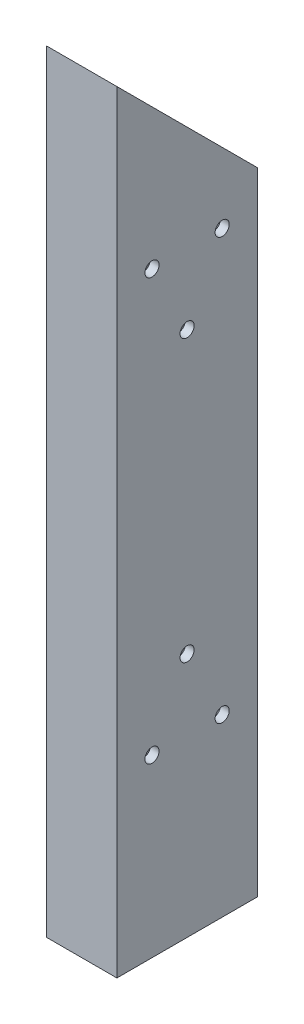
ISO-10303-21;
HEADER;
FILE_DESCRIPTION(('STEP AP214'),'2;1');
FILE_NAME('part.step','',(''),(''),'','','');
FILE_SCHEMA(('AUTOMOTIVE_DESIGN { 1 0 10303 214 1 1 1 1 }'));
ENDSEC;
DATA;
#1=APPLICATION_CONTEXT('core data for automotive mechanical design processes');
#2=APPLICATION_PROTOCOL_DEFINITION('international standard','automotive_design',2000,#1);
#3=PRODUCT_CONTEXT('',#1,'mechanical');
#4=PRODUCT('Part','Part','',(#3));
#5=PRODUCT_RELATED_PRODUCT_CATEGORY('part','',(#4));
#6=PRODUCT_DEFINITION_FORMATION('','',#4);
#7=PRODUCT_DEFINITION_CONTEXT('part definition',#1,'design');
#8=PRODUCT_DEFINITION('design','',#6,#7);
#9=PRODUCT_DEFINITION_SHAPE('','',#8);
#10=(LENGTH_UNIT() NAMED_UNIT(*) SI_UNIT(.MILLI.,.METRE.));
#11=(NAMED_UNIT(*) PLANE_ANGLE_UNIT() SI_UNIT($,.RADIAN.));
#12=(NAMED_UNIT(*) SI_UNIT($,.STERADIAN.) SOLID_ANGLE_UNIT());
#13=UNCERTAINTY_MEASURE_WITH_UNIT(LENGTH_MEASURE(1.E-05),#10,'distance_accuracy_value','');
#14=(GEOMETRIC_REPRESENTATION_CONTEXT(3) GLOBAL_UNCERTAINTY_ASSIGNED_CONTEXT((#13)) GLOBAL_UNIT_ASSIGNED_CONTEXT((#10,
#11,#12)) REPRESENTATION_CONTEXT('',''));
#15=CARTESIAN_POINT('',(0.,0.,0.));
#16=DIRECTION('',(0.,0.,1.));
#17=DIRECTION('',(1.,0.,0.));
#18=AXIS2_PLACEMENT_3D('',#15,#16,#17);
#19=CARTESIAN_POINT('',(0.,0.,0.));
#20=DIRECTION('',(0.,-1.,0.));
#21=DIRECTION('',(0.,0.,-1.));
#22=AXIS2_PLACEMENT_3D('',#19,#20,#21);
#23=PLANE('',#22);
#24=DIRECTION('',(0.,0.,1.));
#25=VECTOR('',#24,1.);
#26=CARTESIAN_POINT('',(0.,0.,0.));
#27=LINE('',#26,#25);
#28=CARTESIAN_POINT('',(0.,0.,-50.8));
#29=VERTEX_POINT('',#28);
#30=CARTESIAN_POINT('',(0.,0.,0.));
#31=VERTEX_POINT('',#30);
#32=EDGE_CURVE('E217',#29,#31,#27,.T.);
#33=ORIENTED_EDGE('',*,*,#32,.F.);
#34=DIRECTION('',(-1.,0.,0.));
#35=VECTOR('',#34,1.);
#36=CARTESIAN_POINT('',(0.,0.,-50.8));
#37=LINE('',#36,#35);
#38=CARTESIAN_POINT('',(25.4,0.,-50.8));
#39=VERTEX_POINT('',#38);
#40=EDGE_CURVE('E106',#39,#29,#37,.T.);
#41=ORIENTED_EDGE('',*,*,#40,.F.);
#42=DIRECTION('',(0.,0.,-1.));
#43=VECTOR('',#42,1.);
#44=CARTESIAN_POINT('',(25.4,0.,0.));
#45=LINE('',#44,#43);
#46=CARTESIAN_POINT('',(25.4,0.,0.));
#47=VERTEX_POINT('',#46);
#48=EDGE_CURVE('E222',#47,#39,#45,.T.);
#49=ORIENTED_EDGE('',*,*,#48,.F.);
#50=DIRECTION('',(1.,0.,0.));
#51=VECTOR('',#50,1.);
#52=CARTESIAN_POINT('',(0.,0.,0.));
#53=LINE('',#52,#51);
#54=EDGE_CURVE('E120',#31,#47,#53,.T.);
#55=ORIENTED_EDGE('',*,*,#54,.F.);
#56=EDGE_LOOP('',(#33,#41,#49,#55));
#57=FACE_BOUND('',#56,.T.);
#58=DIRECTION('',(-1.,0.,0.));
#59=VECTOR('',#58,1.);
#60=CARTESIAN_POINT('',(3.175,0.,-47.625));
#61=LINE('',#60,#59);
#62=CARTESIAN_POINT('',(22.225,0.,-47.625));
#63=VERTEX_POINT('',#62);
#64=CARTESIAN_POINT('',(3.175,0.,-47.625));
#65=VERTEX_POINT('',#64);
#66=EDGE_CURVE('E207',#63,#65,#61,.T.);
#67=ORIENTED_EDGE('',*,*,#66,.T.);
#68=DIRECTION('',(0.,0.,1.));
#69=VECTOR('',#68,1.);
#70=CARTESIAN_POINT('',(3.175,0.,-3.175));
#71=LINE('',#70,#69);
#72=CARTESIAN_POINT('',(3.175,0.,-3.175));
#73=VERTEX_POINT('',#72);
#74=EDGE_CURVE('E198',#65,#73,#71,.T.);
#75=ORIENTED_EDGE('',*,*,#74,.T.);
#76=DIRECTION('',(1.,0.,0.));
#77=VECTOR('',#76,1.);
#78=CARTESIAN_POINT('',(3.175,0.,-3.175));
#79=LINE('',#78,#77);
#80=CARTESIAN_POINT('',(22.225,0.,-3.175));
#81=VERTEX_POINT('',#80);
#82=EDGE_CURVE('E201',#73,#81,#79,.T.);
#83=ORIENTED_EDGE('',*,*,#82,.T.);
#84=DIRECTION('',(0.,0.,-1.));
#85=VECTOR('',#84,1.);
#86=CARTESIAN_POINT('',(22.225,0.,-3.175));
#87=LINE('',#86,#85);
#88=EDGE_CURVE('E204',#81,#63,#87,.T.);
#89=ORIENTED_EDGE('',*,*,#88,.T.);
#90=EDGE_LOOP('',(#67,#75,#83,#89));
#91=FACE_BOUND('',#90,.T.);
#92=ADVANCED_FACE('F33',(#57,#91),#23,.T.);
#93=CARTESIAN_POINT('',(0.,279.4,0.));
#94=DIRECTION('',(1.,0.,0.));
#95=DIRECTION('',(0.,0.,-1.));
#96=AXIS2_PLACEMENT_3D('',#93,#94,#95);
#97=PLANE('',#96);
#98=CARTESIAN_POINT('',(0.,88.9,-25.4));
#99=DIRECTION('',(1.,0.,0.));
#100=DIRECTION('',(0.,0.,-1.));
#101=AXIS2_PLACEMENT_3D('',#98,#99,#100);
#102=CIRCLE('',#101,2.55269999999999);
#103=CARTESIAN_POINT('',(0.,88.9,-27.9527));
#104=VERTEX_POINT('',#103);
#105=EDGE_CURVE('E288',#104,#104,#102,.T.);
#106=ORIENTED_EDGE('',*,*,#105,.T.);
#107=EDGE_LOOP('',(#106));
#108=FACE_BOUND('',#107,.T.);
#109=CARTESIAN_POINT('',(0.,63.5,-38.1));
#110=DIRECTION('',(1.,0.,0.));
#111=DIRECTION('',(0.,0.,-1.));
#112=AXIS2_PLACEMENT_3D('',#109,#110,#111);
#113=CIRCLE('',#112,2.5527);
#114=CARTESIAN_POINT('',(0.,63.5,-40.6527));
#115=VERTEX_POINT('',#114);
#116=EDGE_CURVE('E147',#115,#115,#113,.T.);
#117=ORIENTED_EDGE('',*,*,#116,.T.);
#118=EDGE_LOOP('',(#117));
#119=FACE_BOUND('',#118,.T.);
#120=CARTESIAN_POINT('',(0.,63.5,-12.7));
#121=DIRECTION('',(1.,0.,0.));
#122=DIRECTION('',(0.,0.,-1.));
#123=AXIS2_PLACEMENT_3D('',#120,#121,#122);
#124=CIRCLE('',#123,2.5527);
#125=CARTESIAN_POINT('',(0.,63.5,-15.2527));
#126=VERTEX_POINT('',#125);
#127=EDGE_CURVE('E143',#126,#126,#124,.T.);
#128=ORIENTED_EDGE('',*,*,#127,.T.);
#129=EDGE_LOOP('',(#128));
#130=FACE_BOUND('',#129,.T.);
#131=CARTESIAN_POINT('',(0.,190.5,-25.4));
#132=DIRECTION('',(1.,0.,0.));
#133=DIRECTION('',(0.,0.,-1.));
#134=AXIS2_PLACEMENT_3D('',#131,#132,#133);
#135=CIRCLE('',#134,2.5527);
#136=CARTESIAN_POINT('',(0.,190.5,-27.9527));
#137=VERTEX_POINT('',#136);
#138=EDGE_CURVE('E139',#137,#137,#135,.T.);
#139=ORIENTED_EDGE('',*,*,#138,.T.);
#140=EDGE_LOOP('',(#139));
#141=FACE_BOUND('',#140,.T.);
#142=CARTESIAN_POINT('',(0.,215.9,-38.1));
#143=DIRECTION('',(1.,0.,0.));
#144=DIRECTION('',(0.,0.,-1.));
#145=AXIS2_PLACEMENT_3D('',#142,#143,#144);
#146=CIRCLE('',#145,2.5527);
#147=CARTESIAN_POINT('',(0.,215.9,-40.6527));
#148=VERTEX_POINT('',#147);
#149=EDGE_CURVE('E134',#148,#148,#146,.T.);
#150=ORIENTED_EDGE('',*,*,#149,.T.);
#151=EDGE_LOOP('',(#150));
#152=FACE_BOUND('',#151,.T.);
#153=CARTESIAN_POINT('',(0.,215.9,-12.7));
#154=DIRECTION('',(1.,0.,0.));
#155=DIRECTION('',(0.,0.,-1.));
#156=AXIS2_PLACEMENT_3D('',#153,#154,#155);
#157=CIRCLE('',#156,2.55270000000001);
#158=CARTESIAN_POINT('',(0.,215.9,-15.2527));
#159=VERTEX_POINT('',#158);
#160=EDGE_CURVE('E129',#159,#159,#157,.T.);
#161=ORIENTED_EDGE('',*,*,#160,.T.);
#162=EDGE_LOOP('',(#161));
#163=FACE_BOUND('',#162,.T.);
#164=DIRECTION('',(0.,-1.,0.));
#165=VECTOR('',#164,1.);
#166=CARTESIAN_POINT('',(0.,279.4,0.));
#167=LINE('',#166,#165);
#168=CARTESIAN_POINT('',(0.,279.4,0.));
#169=VERTEX_POINT('',#168);
#170=EDGE_CURVE('E42',#169,#31,#167,.T.);
#171=ORIENTED_EDGE('',*,*,#170,.F.);
#172=DIRECTION('',(0.,-0.707106781186547,-0.707106781186548));
#173=VECTOR('',#172,1.);
#174=CARTESIAN_POINT('',(0.,279.4,0.));
#175=LINE('',#174,#173);
#176=CARTESIAN_POINT('',(0.,228.6,-50.8));
#177=VERTEX_POINT('',#176);
#178=EDGE_CURVE('E100',#169,#177,#175,.T.);
#179=ORIENTED_EDGE('',*,*,#178,.T.);
#180=DIRECTION('',(0.,-1.,0.));
#181=VECTOR('',#180,1.);
#182=CARTESIAN_POINT('',(0.,279.4,-50.8));
#183=LINE('',#182,#181);
#184=EDGE_CURVE('E105',#177,#29,#183,.T.);
#185=ORIENTED_EDGE('',*,*,#184,.T.);
#186=ORIENTED_EDGE('',*,*,#32,.T.);
#187=EDGE_LOOP('',(#171,#179,#185,#186));
#188=FACE_BOUND('',#187,.T.);
#189=ADVANCED_FACE('F35',(#108,#119,#130,#141,#152,#163,#188),#97,.F.);
#190=CARTESIAN_POINT('',(0.,279.4,0.));
#191=DIRECTION('',(0.,0.,-1.));
#192=DIRECTION('',(-1.,0.,0.));
#193=AXIS2_PLACEMENT_3D('',#190,#191,#192);
#194=PLANE('',#193);
#195=ORIENTED_EDGE('',*,*,#54,.T.);
#196=DIRECTION('',(0.,-1.,0.));
#197=VECTOR('',#196,1.);
#198=CARTESIAN_POINT('',(25.4,279.4,0.));
#199=LINE('',#198,#197);
#200=CARTESIAN_POINT('',(25.4,279.4,0.));
#201=VERTEX_POINT('',#200);
#202=EDGE_CURVE('E113',#201,#47,#199,.T.);
#203=ORIENTED_EDGE('',*,*,#202,.F.);
#204=DIRECTION('',(1.,0.,0.));
#205=VECTOR('',#204,1.);
#206=CARTESIAN_POINT('',(0.,279.4,0.));
#207=LINE('',#206,#205);
#208=EDGE_CURVE('E97',#169,#201,#207,.T.);
#209=ORIENTED_EDGE('',*,*,#208,.F.);
#210=ORIENTED_EDGE('',*,*,#170,.T.);
#211=EDGE_LOOP('',(#195,#203,#209,#210));
#212=FACE_BOUND('',#211,.T.);
#213=ADVANCED_FACE('F119',(#212),#194,.F.);
#214=CARTESIAN_POINT('',(25.4,279.4,0.));
#215=DIRECTION('',(-1.,0.,0.));
#216=DIRECTION('',(0.,0.,1.));
#217=AXIS2_PLACEMENT_3D('',#214,#215,#216);
#218=PLANE('',#217);
#219=CARTESIAN_POINT('',(25.4,88.9,-25.4));
#220=DIRECTION('',(1.,0.,0.));
#221=DIRECTION('',(0.,0.,-1.));
#222=AXIS2_PLACEMENT_3D('',#219,#220,#221);
#223=CIRCLE('',#222,2.55269999999999);
#224=CARTESIAN_POINT('',(25.4,88.9,-27.9527));
#225=VERTEX_POINT('',#224);
#226=EDGE_CURVE('E343',#225,#225,#223,.T.);
#227=ORIENTED_EDGE('',*,*,#226,.F.);
#228=EDGE_LOOP('',(#227));
#229=FACE_BOUND('',#228,.T.);
#230=CARTESIAN_POINT('',(25.4,63.5,-38.1));
#231=DIRECTION('',(1.,0.,0.));
#232=DIRECTION('',(0.,0.,-1.));
#233=AXIS2_PLACEMENT_3D('',#230,#231,#232);
#234=CIRCLE('',#233,2.5527);
#235=CARTESIAN_POINT('',(25.4,63.5,-40.6527));
#236=VERTEX_POINT('',#235);
#237=EDGE_CURVE('E154',#236,#236,#234,.T.);
#238=ORIENTED_EDGE('',*,*,#237,.F.);
#239=EDGE_LOOP('',(#238));
#240=FACE_BOUND('',#239,.T.);
#241=CARTESIAN_POINT('',(25.4,63.5,-12.7));
#242=DIRECTION('',(1.,0.,0.));
#243=DIRECTION('',(0.,0.,-1.));
#244=AXIS2_PLACEMENT_3D('',#241,#242,#243);
#245=CIRCLE('',#244,2.5527);
#246=CARTESIAN_POINT('',(25.4,63.5,-15.2527));
#247=VERTEX_POINT('',#246);
#248=EDGE_CURVE('E151',#247,#247,#245,.T.);
#249=ORIENTED_EDGE('',*,*,#248,.F.);
#250=EDGE_LOOP('',(#249));
#251=FACE_BOUND('',#250,.T.);
#252=CARTESIAN_POINT('',(25.4,190.5,-25.4));
#253=DIRECTION('',(1.,0.,0.));
#254=DIRECTION('',(0.,0.,-1.));
#255=AXIS2_PLACEMENT_3D('',#252,#253,#254);
#256=CIRCLE('',#255,2.5527);
#257=CARTESIAN_POINT('',(25.4,190.5,-27.9527));
#258=VERTEX_POINT('',#257);
#259=EDGE_CURVE('E170',#258,#258,#256,.T.);
#260=ORIENTED_EDGE('',*,*,#259,.F.);
#261=EDGE_LOOP('',(#260));
#262=FACE_BOUND('',#261,.T.);
#263=CARTESIAN_POINT('',(25.4,215.9,-38.1));
#264=DIRECTION('',(1.,0.,0.));
#265=DIRECTION('',(0.,0.,-1.));
#266=AXIS2_PLACEMENT_3D('',#263,#264,#265);
#267=CIRCLE('',#266,2.5527);
#268=CARTESIAN_POINT('',(25.4,215.9,-40.6527));
#269=VERTEX_POINT('',#268);
#270=EDGE_CURVE('E177',#269,#269,#267,.T.);
#271=ORIENTED_EDGE('',*,*,#270,.F.);
#272=EDGE_LOOP('',(#271));
#273=FACE_BOUND('',#272,.T.);
#274=CARTESIAN_POINT('',(25.4,215.9,-12.7));
#275=DIRECTION('',(1.,0.,0.));
#276=DIRECTION('',(0.,0.,-1.));
#277=AXIS2_PLACEMENT_3D('',#274,#275,#276);
#278=CIRCLE('',#277,2.55270000000001);
#279=CARTESIAN_POINT('',(25.4,215.9,-15.2527));
#280=VERTEX_POINT('',#279);
#281=EDGE_CURVE('E184',#280,#280,#278,.T.);
#282=ORIENTED_EDGE('',*,*,#281,.F.);
#283=EDGE_LOOP('',(#282));
#284=FACE_BOUND('',#283,.T.);
#285=DIRECTION('',(0.,-1.,0.));
#286=VECTOR('',#285,1.);
#287=CARTESIAN_POINT('',(25.4,279.4,-50.8));
#288=LINE('',#287,#286);
#289=CARTESIAN_POINT('',(25.4,228.6,-50.8));
#290=VERTEX_POINT('',#289);
#291=EDGE_CURVE('E115',#290,#39,#288,.T.);
#292=ORIENTED_EDGE('',*,*,#291,.F.);
#293=DIRECTION('',(0.,-0.707106781186547,-0.707106781186548));
#294=VECTOR('',#293,1.);
#295=CARTESIAN_POINT('',(25.4,279.4,0.));
#296=LINE('',#295,#294);
#297=EDGE_CURVE('E50',#201,#290,#296,.T.);
#298=ORIENTED_EDGE('',*,*,#297,.F.);
#299=ORIENTED_EDGE('',*,*,#202,.T.);
#300=ORIENTED_EDGE('',*,*,#48,.T.);
#301=EDGE_LOOP('',(#292,#298,#299,#300));
#302=FACE_BOUND('',#301,.T.);
#303=ADVANCED_FACE('F111',(#229,#240,#251,#262,#273,#284,#302),#218,.F.);
#304=CARTESIAN_POINT('',(0.,279.4,-50.8));
#305=DIRECTION('',(0.,0.,1.));
#306=DIRECTION('',(1.,0.,0.));
#307=AXIS2_PLACEMENT_3D('',#304,#305,#306);
#308=PLANE('',#307);
#309=ORIENTED_EDGE('',*,*,#184,.F.);
#310=DIRECTION('',(1.,0.,0.));
#311=VECTOR('',#310,1.);
#312=CARTESIAN_POINT('',(-254.,228.6,-50.8));
#313=LINE('',#312,#311);
#314=EDGE_CURVE('E116',#177,#290,#313,.T.);
#315=ORIENTED_EDGE('',*,*,#314,.T.);
#316=ORIENTED_EDGE('',*,*,#291,.T.);
#317=ORIENTED_EDGE('',*,*,#40,.T.);
#318=EDGE_LOOP('',(#309,#315,#316,#317));
#319=FACE_BOUND('',#318,.T.);
#320=ADVANCED_FACE('F230',(#319),#308,.F.);
#321=CARTESIAN_POINT('',(3.175,279.4,-3.175));
#322=DIRECTION('',(1.,0.,0.));
#323=DIRECTION('',(0.,0.,-1.));
#324=AXIS2_PLACEMENT_3D('',#321,#322,#323);
#325=PLANE('',#324);
#326=CARTESIAN_POINT('',(3.175,88.9,-25.4));
#327=DIRECTION('',(1.,0.,0.));
#328=DIRECTION('',(0.,0.,-1.));
#329=AXIS2_PLACEMENT_3D('',#326,#327,#328);
#330=CIRCLE('',#329,2.55269999999999);
#331=CARTESIAN_POINT('',(3.175,88.9,-27.9527));
#332=VERTEX_POINT('',#331);
#333=EDGE_CURVE('E159',#332,#332,#330,.T.);
#334=ORIENTED_EDGE('',*,*,#333,.F.);
#335=EDGE_LOOP('',(#334));
#336=FACE_BOUND('',#335,.T.);
#337=CARTESIAN_POINT('',(3.175,63.5,-38.1));
#338=DIRECTION('',(1.,0.,0.));
#339=DIRECTION('',(0.,0.,-1.));
#340=AXIS2_PLACEMENT_3D('',#337,#338,#339);
#341=CIRCLE('',#340,2.5527);
#342=CARTESIAN_POINT('',(3.175,63.5,-40.6527));
#343=VERTEX_POINT('',#342);
#344=EDGE_CURVE('E146',#343,#343,#341,.T.);
#345=ORIENTED_EDGE('',*,*,#344,.F.);
#346=EDGE_LOOP('',(#345));
#347=FACE_BOUND('',#346,.T.);
#348=CARTESIAN_POINT('',(3.175,63.5,-12.7));
#349=DIRECTION('',(1.,0.,0.));
#350=DIRECTION('',(0.,0.,-1.));
#351=AXIS2_PLACEMENT_3D('',#348,#349,#350);
#352=CIRCLE('',#351,2.5527);
#353=CARTESIAN_POINT('',(3.175,63.5,-15.2527));
#354=VERTEX_POINT('',#353);
#355=EDGE_CURVE('E142',#354,#354,#352,.T.);
#356=ORIENTED_EDGE('',*,*,#355,.F.);
#357=EDGE_LOOP('',(#356));
#358=FACE_BOUND('',#357,.T.);
#359=CARTESIAN_POINT('',(3.175,190.5,-25.4));
#360=DIRECTION('',(1.,0.,0.));
#361=DIRECTION('',(0.,0.,-1.));
#362=AXIS2_PLACEMENT_3D('',#359,#360,#361);
#363=CIRCLE('',#362,2.5527);
#364=CARTESIAN_POINT('',(3.175,190.5,-27.9527));
#365=VERTEX_POINT('',#364);
#366=EDGE_CURVE('E138',#365,#365,#363,.T.);
#367=ORIENTED_EDGE('',*,*,#366,.F.);
#368=EDGE_LOOP('',(#367));
#369=FACE_BOUND('',#368,.T.);
#370=CARTESIAN_POINT('',(3.175,215.9,-38.1));
#371=DIRECTION('',(1.,0.,0.));
#372=DIRECTION('',(0.,0.,-1.));
#373=AXIS2_PLACEMENT_3D('',#370,#371,#372);
#374=CIRCLE('',#373,2.5527);
#375=CARTESIAN_POINT('',(3.175,215.9,-40.6527));
#376=VERTEX_POINT('',#375);
#377=EDGE_CURVE('E133',#376,#376,#374,.T.);
#378=ORIENTED_EDGE('',*,*,#377,.F.);
#379=EDGE_LOOP('',(#378));
#380=FACE_BOUND('',#379,.T.);
#381=CARTESIAN_POINT('',(3.175,215.9,-12.7));
#382=DIRECTION('',(1.,0.,0.));
#383=DIRECTION('',(0.,0.,-1.));
#384=AXIS2_PLACEMENT_3D('',#381,#382,#383);
#385=CIRCLE('',#384,2.55270000000001);
#386=CARTESIAN_POINT('',(3.175,215.9,-15.2527));
#387=VERTEX_POINT('',#386);
#388=EDGE_CURVE('E117',#387,#387,#385,.T.);
#389=ORIENTED_EDGE('',*,*,#388,.F.);
#390=EDGE_LOOP('',(#389));
#391=FACE_BOUND('',#390,.T.);
#392=DIRECTION('',(0.,-0.707106781186547,-0.707106781186548));
#393=VECTOR('',#392,1.);
#394=CARTESIAN_POINT('',(3.175,277.8125,-1.5875));
#395=LINE('',#394,#393);
#396=CARTESIAN_POINT('',(3.175,276.225,-3.175));
#397=VERTEX_POINT('',#396);
#398=CARTESIAN_POINT('',(3.175,231.775,-47.625));
#399=VERTEX_POINT('',#398);
#400=EDGE_CURVE('E57',#397,#399,#395,.T.);
#401=ORIENTED_EDGE('',*,*,#400,.F.);
#402=DIRECTION('',(0.,-1.,0.));
#403=VECTOR('',#402,1.);
#404=CARTESIAN_POINT('',(3.175,279.4,-3.175));
#405=LINE('',#404,#403);
#406=EDGE_CURVE('E216',#397,#73,#405,.T.);
#407=ORIENTED_EDGE('',*,*,#406,.T.);
#408=ORIENTED_EDGE('',*,*,#74,.F.);
#409=DIRECTION('',(0.,-1.,0.));
#410=VECTOR('',#409,1.);
#411=CARTESIAN_POINT('',(3.175,279.4,-47.625));
#412=LINE('',#411,#410);
#413=EDGE_CURVE('E210',#399,#65,#412,.T.);
#414=ORIENTED_EDGE('',*,*,#413,.F.);
#415=EDGE_LOOP('',(#401,#407,#408,#414));
#416=FACE_BOUND('',#415,.T.);
#417=ADVANCED_FACE('F243',(#336,#347,#358,#369,#380,#391,#416),#325,.T.);
#418=CARTESIAN_POINT('',(3.175,279.4,-3.175));
#419=DIRECTION('',(0.,0.,-1.));
#420=DIRECTION('',(-1.,0.,0.));
#421=AXIS2_PLACEMENT_3D('',#418,#419,#420);
#422=PLANE('',#421);
#423=DIRECTION('',(-1.,0.,0.));
#424=VECTOR('',#423,1.);
#425=CARTESIAN_POINT('',(3.175,276.225,-3.175));
#426=LINE('',#425,#424);
#427=CARTESIAN_POINT('',(22.225,276.225,-3.175));
#428=VERTEX_POINT('',#427);
#429=EDGE_CURVE('E194',#428,#397,#426,.T.);
#430=ORIENTED_EDGE('',*,*,#429,.F.);
#431=DIRECTION('',(0.,-1.,0.));
#432=VECTOR('',#431,1.);
#433=CARTESIAN_POINT('',(22.225,279.4,-3.175));
#434=LINE('',#433,#432);
#435=EDGE_CURVE('E214',#428,#81,#434,.T.);
#436=ORIENTED_EDGE('',*,*,#435,.T.);
#437=ORIENTED_EDGE('',*,*,#82,.F.);
#438=ORIENTED_EDGE('',*,*,#406,.F.);
#439=EDGE_LOOP('',(#430,#436,#437,#438));
#440=FACE_BOUND('',#439,.T.);
#441=ADVANCED_FACE('F248',(#440),#422,.T.);
#442=CARTESIAN_POINT('',(22.225,279.4,-3.175));
#443=DIRECTION('',(-1.,0.,0.));
#444=DIRECTION('',(0.,0.,1.));
#445=AXIS2_PLACEMENT_3D('',#442,#443,#444);
#446=PLANE('',#445);
#447=CARTESIAN_POINT('',(22.225,88.9,-25.4));
#448=DIRECTION('',(-1.,0.,0.));
#449=DIRECTION('',(0.,0.,1.));
#450=AXIS2_PLACEMENT_3D('',#447,#448,#449);
#451=CIRCLE('',#450,2.55269999999999);
#452=CARTESIAN_POINT('',(22.225,88.9,-22.8473));
#453=VERTEX_POINT('',#452);
#454=EDGE_CURVE('E37',#453,#453,#451,.T.);
#455=ORIENTED_EDGE('',*,*,#454,.F.);
#456=EDGE_LOOP('',(#455));
#457=FACE_BOUND('',#456,.T.);
#458=CARTESIAN_POINT('',(22.225,63.5,-38.1));
#459=DIRECTION('',(-1.,0.,0.));
#460=DIRECTION('',(0.,0.,1.));
#461=AXIS2_PLACEMENT_3D('',#458,#459,#460);
#462=CIRCLE('',#461,2.5527);
#463=CARTESIAN_POINT('',(22.225,63.5,-35.5473));
#464=VERTEX_POINT('',#463);
#465=EDGE_CURVE('E144',#464,#464,#462,.T.);
#466=ORIENTED_EDGE('',*,*,#465,.F.);
#467=EDGE_LOOP('',(#466));
#468=FACE_BOUND('',#467,.T.);
#469=CARTESIAN_POINT('',(22.225,63.5,-12.7));
#470=DIRECTION('',(-1.,0.,0.));
#471=DIRECTION('',(0.,0.,1.));
#472=AXIS2_PLACEMENT_3D('',#469,#470,#471);
#473=CIRCLE('',#472,2.5527);
#474=CARTESIAN_POINT('',(22.225,63.5,-10.1473));
#475=VERTEX_POINT('',#474);
#476=EDGE_CURVE('E140',#475,#475,#473,.T.);
#477=ORIENTED_EDGE('',*,*,#476,.F.);
#478=EDGE_LOOP('',(#477));
#479=FACE_BOUND('',#478,.T.);
#480=CARTESIAN_POINT('',(22.225,190.5,-25.4));
#481=DIRECTION('',(-1.,0.,0.));
#482=DIRECTION('',(0.,0.,1.));
#483=AXIS2_PLACEMENT_3D('',#480,#481,#482);
#484=CIRCLE('',#483,2.5527);
#485=CARTESIAN_POINT('',(22.225,190.5,-22.8473));
#486=VERTEX_POINT('',#485);
#487=EDGE_CURVE('E135',#486,#486,#484,.T.);
#488=ORIENTED_EDGE('',*,*,#487,.F.);
#489=EDGE_LOOP('',(#488));
#490=FACE_BOUND('',#489,.T.);
#491=CARTESIAN_POINT('',(22.225,215.9,-38.1));
#492=DIRECTION('',(-1.,0.,0.));
#493=DIRECTION('',(0.,0.,1.));
#494=AXIS2_PLACEMENT_3D('',#491,#492,#493);
#495=CIRCLE('',#494,2.5527);
#496=CARTESIAN_POINT('',(22.225,215.9,-35.5473));
#497=VERTEX_POINT('',#496);
#498=EDGE_CURVE('E130',#497,#497,#495,.T.);
#499=ORIENTED_EDGE('',*,*,#498,.F.);
#500=EDGE_LOOP('',(#499));
#501=FACE_BOUND('',#500,.T.);
#502=CARTESIAN_POINT('',(22.225,215.9,-12.7));
#503=DIRECTION('',(-1.,0.,0.));
#504=DIRECTION('',(0.,0.,1.));
#505=AXIS2_PLACEMENT_3D('',#502,#503,#504);
#506=CIRCLE('',#505,2.55270000000001);
#507=CARTESIAN_POINT('',(22.225,215.9,-10.1473));
#508=VERTEX_POINT('',#507);
#509=EDGE_CURVE('E126',#508,#508,#506,.T.);
#510=ORIENTED_EDGE('',*,*,#509,.F.);
#511=EDGE_LOOP('',(#510));
#512=FACE_BOUND('',#511,.T.);
#513=DIRECTION('',(0.,0.707106781186547,0.707106781186548));
#514=VECTOR('',#513,1.);
#515=CARTESIAN_POINT('',(22.225,277.8125,-1.5875));
#516=LINE('',#515,#514);
#517=CARTESIAN_POINT('',(22.225,231.775,-47.625));
#518=VERTEX_POINT('',#517);
#519=EDGE_CURVE('E192',#518,#428,#516,.T.);
#520=ORIENTED_EDGE('',*,*,#519,.F.);
#521=DIRECTION('',(0.,-1.,0.));
#522=VECTOR('',#521,1.);
#523=CARTESIAN_POINT('',(22.225,279.4,-47.625));
#524=LINE('',#523,#522);
#525=EDGE_CURVE('E212',#518,#63,#524,.T.);
#526=ORIENTED_EDGE('',*,*,#525,.T.);
#527=ORIENTED_EDGE('',*,*,#88,.F.);
#528=ORIENTED_EDGE('',*,*,#435,.F.);
#529=EDGE_LOOP('',(#520,#526,#527,#528));
#530=FACE_BOUND('',#529,.T.);
#531=ADVANCED_FACE('F252',(#457,#468,#479,#490,#501,#512,#530),#446,.T.);
#532=CARTESIAN_POINT('',(3.175,279.4,-47.625));
#533=DIRECTION('',(0.,0.,1.));
#534=DIRECTION('',(1.,0.,0.));
#535=AXIS2_PLACEMENT_3D('',#532,#533,#534);
#536=PLANE('',#535);
#537=DIRECTION('',(1.,0.,0.));
#538=VECTOR('',#537,1.);
#539=CARTESIAN_POINT('',(3.175,231.775,-47.625));
#540=LINE('',#539,#538);
#541=EDGE_CURVE('E11',#399,#518,#540,.T.);
#542=ORIENTED_EDGE('',*,*,#541,.F.);
#543=ORIENTED_EDGE('',*,*,#413,.T.);
#544=ORIENTED_EDGE('',*,*,#66,.F.);
#545=ORIENTED_EDGE('',*,*,#525,.F.);
#546=EDGE_LOOP('',(#542,#543,#544,#545));
#547=FACE_BOUND('',#546,.T.);
#548=ADVANCED_FACE('F240',(#547),#536,.T.);
#549=CARTESIAN_POINT('',(-254.,279.4,0.));
#550=DIRECTION('',(0.,-0.707106781186548,0.707106781186547));
#551=DIRECTION('',(0.,-0.707106781186547,-0.707106781186548));
#552=AXIS2_PLACEMENT_3D('',#549,#550,#551);
#553=PLANE('',#552);
#554=ORIENTED_EDGE('',*,*,#400,.T.);
#555=ORIENTED_EDGE('',*,*,#541,.T.);
#556=ORIENTED_EDGE('',*,*,#519,.T.);
#557=ORIENTED_EDGE('',*,*,#429,.T.);
#558=EDGE_LOOP('',(#554,#555,#556,#557));
#559=FACE_BOUND('',#558,.T.);
#560=ORIENTED_EDGE('',*,*,#208,.T.);
#561=ORIENTED_EDGE('',*,*,#297,.T.);
#562=ORIENTED_EDGE('',*,*,#314,.F.);
#563=ORIENTED_EDGE('',*,*,#178,.F.);
#564=EDGE_LOOP('',(#560,#561,#562,#563));
#565=FACE_BOUND('',#564,.T.);
#566=ADVANCED_FACE('F98',(#559,#565),#553,.F.);
#567=CARTESIAN_POINT('',(0.,215.9,-12.7));
#568=DIRECTION('',(1.,0.,0.));
#569=DIRECTION('',(0.,0.,-1.));
#570=AXIS2_PLACEMENT_3D('',#567,#568,#569);
#571=CYLINDRICAL_SURFACE('',#570,2.55270000000001);
#572=ORIENTED_EDGE('',*,*,#509,.T.);
#573=EDGE_LOOP('',(#572));
#574=FACE_BOUND('',#573,.T.);
#575=ORIENTED_EDGE('',*,*,#281,.T.);
#576=EDGE_LOOP('',(#575));
#577=FACE_BOUND('',#576,.T.);
#578=ADVANCED_FACE('F254',(#574,#577),#571,.F.);
#579=ORIENTED_EDGE('',*,*,#388,.T.);
#580=EDGE_LOOP('',(#579));
#581=FACE_BOUND('',#580,.T.);
#582=ORIENTED_EDGE('',*,*,#160,.F.);
#583=EDGE_LOOP('',(#582));
#584=FACE_BOUND('',#583,.T.);
#585=ADVANCED_FACE('F260',(#581,#584),#571,.F.);
#586=CARTESIAN_POINT('',(0.,215.9,-38.1));
#587=DIRECTION('',(1.,0.,0.));
#588=DIRECTION('',(0.,0.,-1.));
#589=AXIS2_PLACEMENT_3D('',#586,#587,#588);
#590=CYLINDRICAL_SURFACE('',#589,2.5527);
#591=ORIENTED_EDGE('',*,*,#498,.T.);
#592=EDGE_LOOP('',(#591));
#593=FACE_BOUND('',#592,.T.);
#594=ORIENTED_EDGE('',*,*,#270,.T.);
#595=EDGE_LOOP('',(#594));
#596=FACE_BOUND('',#595,.T.);
#597=ADVANCED_FACE('F299',(#593,#596),#590,.F.);
#598=ORIENTED_EDGE('',*,*,#377,.T.);
#599=EDGE_LOOP('',(#598));
#600=FACE_BOUND('',#599,.T.);
#601=ORIENTED_EDGE('',*,*,#149,.F.);
#602=EDGE_LOOP('',(#601));
#603=FACE_BOUND('',#602,.T.);
#604=ADVANCED_FACE('F304',(#600,#603),#590,.F.);
#605=CARTESIAN_POINT('',(0.,190.5,-25.4));
#606=DIRECTION('',(1.,0.,0.));
#607=DIRECTION('',(0.,0.,-1.));
#608=AXIS2_PLACEMENT_3D('',#605,#606,#607);
#609=CYLINDRICAL_SURFACE('',#608,2.5527);
#610=ORIENTED_EDGE('',*,*,#487,.T.);
#611=EDGE_LOOP('',(#610));
#612=FACE_BOUND('',#611,.T.);
#613=ORIENTED_EDGE('',*,*,#259,.T.);
#614=EDGE_LOOP('',(#613));
#615=FACE_BOUND('',#614,.T.);
#616=ADVANCED_FACE('F311',(#612,#615),#609,.F.);
#617=ORIENTED_EDGE('',*,*,#366,.T.);
#618=EDGE_LOOP('',(#617));
#619=FACE_BOUND('',#618,.T.);
#620=ORIENTED_EDGE('',*,*,#138,.F.);
#621=EDGE_LOOP('',(#620));
#622=FACE_BOUND('',#621,.T.);
#623=ADVANCED_FACE('F317',(#619,#622),#609,.F.);
#624=CARTESIAN_POINT('',(0.,63.5,-12.7));
#625=DIRECTION('',(1.,0.,0.));
#626=DIRECTION('',(0.,0.,-1.));
#627=AXIS2_PLACEMENT_3D('',#624,#625,#626);
#628=CYLINDRICAL_SURFACE('',#627,2.5527);
#629=ORIENTED_EDGE('',*,*,#476,.T.);
#630=EDGE_LOOP('',(#629));
#631=FACE_BOUND('',#630,.T.);
#632=ORIENTED_EDGE('',*,*,#248,.T.);
#633=EDGE_LOOP('',(#632));
#634=FACE_BOUND('',#633,.T.);
#635=ADVANCED_FACE('F319',(#631,#634),#628,.F.);
#636=ORIENTED_EDGE('',*,*,#355,.T.);
#637=EDGE_LOOP('',(#636));
#638=FACE_BOUND('',#637,.T.);
#639=ORIENTED_EDGE('',*,*,#127,.F.);
#640=EDGE_LOOP('',(#639));
#641=FACE_BOUND('',#640,.T.);
#642=ADVANCED_FACE('F322',(#638,#641),#628,.F.);
#643=CARTESIAN_POINT('',(0.,63.5,-38.1));
#644=DIRECTION('',(1.,0.,0.));
#645=DIRECTION('',(0.,0.,-1.));
#646=AXIS2_PLACEMENT_3D('',#643,#644,#645);
#647=CYLINDRICAL_SURFACE('',#646,2.5527);
#648=ORIENTED_EDGE('',*,*,#465,.T.);
#649=EDGE_LOOP('',(#648));
#650=FACE_BOUND('',#649,.T.);
#651=ORIENTED_EDGE('',*,*,#237,.T.);
#652=EDGE_LOOP('',(#651));
#653=FACE_BOUND('',#652,.T.);
#654=ADVANCED_FACE('F324',(#650,#653),#647,.F.);
#655=ORIENTED_EDGE('',*,*,#344,.T.);
#656=EDGE_LOOP('',(#655));
#657=FACE_BOUND('',#656,.T.);
#658=ORIENTED_EDGE('',*,*,#116,.F.);
#659=EDGE_LOOP('',(#658));
#660=FACE_BOUND('',#659,.T.);
#661=ADVANCED_FACE('F327',(#657,#660),#647,.F.);
#662=CARTESIAN_POINT('',(0.,88.9,-25.4));
#663=DIRECTION('',(1.,0.,0.));
#664=DIRECTION('',(0.,0.,-1.));
#665=AXIS2_PLACEMENT_3D('',#662,#663,#664);
#666=CYLINDRICAL_SURFACE('',#665,2.55269999999999);
#667=ORIENTED_EDGE('',*,*,#454,.T.);
#668=EDGE_LOOP('',(#667));
#669=FACE_BOUND('',#668,.T.);
#670=ORIENTED_EDGE('',*,*,#226,.T.);
#671=EDGE_LOOP('',(#670));
#672=FACE_BOUND('',#671,.T.);
#673=ADVANCED_FACE('F328',(#669,#672),#666,.F.);
#674=ORIENTED_EDGE('',*,*,#333,.T.);
#675=EDGE_LOOP('',(#674));
#676=FACE_BOUND('',#675,.T.);
#677=ORIENTED_EDGE('',*,*,#105,.F.);
#678=EDGE_LOOP('',(#677));
#679=FACE_BOUND('',#678,.T.);
#680=ADVANCED_FACE('F330',(#676,#679),#666,.F.);
#681=CLOSED_SHELL('',(#92,#189,#213,#303,#320,#417,#441,#531,#548,#566,#578,#585,#597,#604,#616,
#623,#635,#642,#654,#661,#673,#680));
#682=MANIFOLD_SOLID_BREP('B2',#681);
#683=ADVANCED_BREP_SHAPE_REPRESENTATION('',(#18,#682),#14);
#684=SHAPE_DEFINITION_REPRESENTATION(#9,#683);
ENDSEC;
END-ISO-10303-21;
